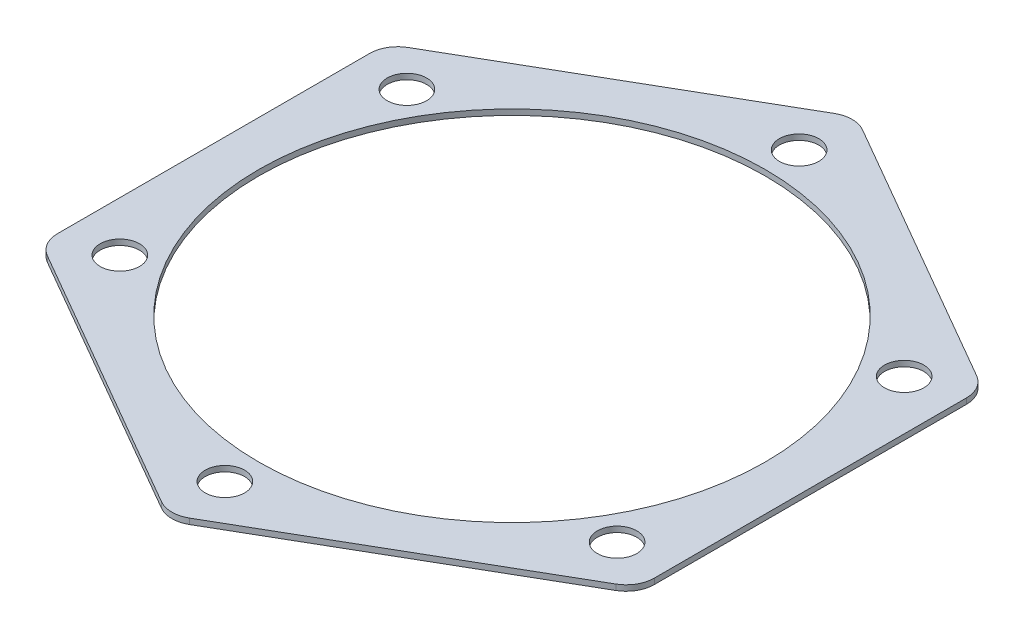
ISO-10303-21;
HEADER;
FILE_DESCRIPTION(('STEP AP214'),'2;1');
FILE_NAME('part.step','',(''),(''),'','','');
FILE_SCHEMA(('AUTOMOTIVE_DESIGN { 1 0 10303 214 1 1 1 1 }'));
ENDSEC;
DATA;
#1=APPLICATION_CONTEXT('core data for automotive mechanical design processes');
#2=APPLICATION_PROTOCOL_DEFINITION('international standard','automotive_design',2000,#1);
#3=PRODUCT_CONTEXT('',#1,'mechanical');
#4=PRODUCT('Part','Part','',(#3));
#5=PRODUCT_RELATED_PRODUCT_CATEGORY('part','',(#4));
#6=PRODUCT_DEFINITION_FORMATION('','',#4);
#7=PRODUCT_DEFINITION_CONTEXT('part definition',#1,'design');
#8=PRODUCT_DEFINITION('design','',#6,#7);
#9=PRODUCT_DEFINITION_SHAPE('','',#8);
#10=(LENGTH_UNIT() NAMED_UNIT(*) SI_UNIT(.MILLI.,.METRE.));
#11=(NAMED_UNIT(*) PLANE_ANGLE_UNIT() SI_UNIT($,.RADIAN.));
#12=(NAMED_UNIT(*) SI_UNIT($,.STERADIAN.) SOLID_ANGLE_UNIT());
#13=UNCERTAINTY_MEASURE_WITH_UNIT(LENGTH_MEASURE(1.E-05),#10,'distance_accuracy_value','');
#14=(GEOMETRIC_REPRESENTATION_CONTEXT(3) GLOBAL_UNCERTAINTY_ASSIGNED_CONTEXT((#13)) GLOBAL_UNIT_ASSIGNED_CONTEXT((#10,
#11,#12)) REPRESENTATION_CONTEXT('',''));
#15=CARTESIAN_POINT('',(0.,0.,0.));
#16=DIRECTION('',(0.,0.,1.));
#17=DIRECTION('',(1.,0.,0.));
#18=AXIS2_PLACEMENT_3D('',#15,#16,#17);
#19=CARTESIAN_POINT('',(0.,1.,-55.4256258422041));
#20=DIRECTION('',(0.,-1.,0.));
#21=DIRECTION('',(0.,0.,-1.));
#22=AXIS2_PLACEMENT_3D('',#19,#20,#21);
#23=PLANE('',#22);
#24=CARTESIAN_POINT('',(44.1672955930061,1.,-25.5000000000005));
#25=DIRECTION('',(0.,1.,0.));
#26=DIRECTION('',(-0.866025403784433,0.,0.50000000000001));
#27=AXIS2_PLACEMENT_3D('',#24,#25,#26);
#28=CIRCLE('',#27,3.5);
#29=CARTESIAN_POINT('',(41.1362066797606,1.,-23.7500000000005));
#30=VERTEX_POINT('',#29);
#31=EDGE_CURVE('E326',#30,#30,#28,.T.);
#32=ORIENTED_EDGE('',*,*,#31,.F.);
#33=EDGE_LOOP('',(#32));
#34=FACE_BOUND('',#33,.T.);
#35=CARTESIAN_POINT('',(44.1672955930066,1.,25.4999999999996));
#36=DIRECTION('',(0.,1.,0.));
#37=DIRECTION('',(-0.866025403784443,0.,-0.499999999999992));
#38=AXIS2_PLACEMENT_3D('',#35,#36,#37);
#39=CIRCLE('',#38,3.5);
#40=CARTESIAN_POINT('',(41.1362066797611,1.,23.7499999999996));
#41=VERTEX_POINT('',#40);
#42=EDGE_CURVE('E320',#41,#41,#39,.T.);
#43=ORIENTED_EDGE('',*,*,#42,.F.);
#44=EDGE_LOOP('',(#43));
#45=FACE_BOUND('',#44,.T.);
#46=CARTESIAN_POINT('',(0.,1.,51.));
#47=DIRECTION('',(0.,1.,0.));
#48=DIRECTION('',(0.,0.,-1.));
#49=AXIS2_PLACEMENT_3D('',#46,#47,#48);
#50=CIRCLE('',#49,3.5);
#51=CARTESIAN_POINT('',(0.,1.,47.5));
#52=VERTEX_POINT('',#51);
#53=EDGE_CURVE('E312',#52,#52,#50,.T.);
#54=ORIENTED_EDGE('',*,*,#53,.F.);
#55=EDGE_LOOP('',(#54));
#56=FACE_BOUND('',#55,.T.);
#57=CARTESIAN_POINT('',(-44.1672955930063,1.,25.5000000000002));
#58=DIRECTION('',(0.,1.,0.));
#59=DIRECTION('',(0.866025403784436,0.,-0.500000000000004));
#60=AXIS2_PLACEMENT_3D('',#57,#58,#59);
#61=CIRCLE('',#60,3.5);
#62=CARTESIAN_POINT('',(-41.1362066797607,1.,23.7500000000002));
#63=VERTEX_POINT('',#62);
#64=EDGE_CURVE('E305',#63,#63,#61,.T.);
#65=ORIENTED_EDGE('',*,*,#64,.F.);
#66=EDGE_LOOP('',(#65));
#67=FACE_BOUND('',#66,.T.);
#68=CARTESIAN_POINT('',(-44.1672955930064,1.,-25.4999999999999));
#69=DIRECTION('',(0.,1.,0.));
#70=DIRECTION('',(0.86602540378444,0.,0.499999999999998));
#71=AXIS2_PLACEMENT_3D('',#68,#69,#70);
#72=CIRCLE('',#71,3.5);
#73=CARTESIAN_POINT('',(-41.1362066797609,1.,-23.7499999999999));
#74=VERTEX_POINT('',#73);
#75=EDGE_CURVE('E309',#74,#74,#72,.T.);
#76=ORIENTED_EDGE('',*,*,#75,.F.);
#77=EDGE_LOOP('',(#76));
#78=FACE_BOUND('',#77,.T.);
#79=CARTESIAN_POINT('',(0.,1.,-51.));
#80=DIRECTION('',(0.,1.,0.));
#81=DIRECTION('',(0.,0.,1.));
#82=AXIS2_PLACEMENT_3D('',#79,#80,#81);
#83=CIRCLE('',#82,3.5);
#84=CARTESIAN_POINT('',(0.,1.,-47.5));
#85=VERTEX_POINT('',#84);
#86=EDGE_CURVE('E332',#85,#85,#83,.T.);
#87=ORIENTED_EDGE('',*,*,#86,.F.);
#88=EDGE_LOOP('',(#87));
#89=FACE_BOUND('',#88,.T.);
#90=CARTESIAN_POINT('',(0.,1.,-55.4256258422041));
#91=DIRECTION('',(0.,1.,0.));
#92=DIRECTION('',(0.,0.,-1.));
#93=AXIS2_PLACEMENT_3D('',#90,#91,#92);
#94=CIRCLE('',#93,5.);
#95=CARTESIAN_POINT('',(2.49999999999999,1.,-59.7557528611263));
#96=VERTEX_POINT('',#95);
#97=CARTESIAN_POINT('',(-2.50000000000005,1.,-59.7557528611263));
#98=VERTEX_POINT('',#97);
#99=EDGE_CURVE('E184',#96,#98,#94,.T.);
#100=ORIENTED_EDGE('',*,*,#99,.T.);
#101=DIRECTION('',(-0.866025403784438,0.,0.5));
#102=VECTOR('',#101,1.);
#103=CARTESIAN_POINT('',(-2.50000000000005,1.,-59.7557528611263));
#104=LINE('',#103,#102);
#105=CARTESIAN_POINT('',(-50.5,1.,-32.0429399400242));
#106=VERTEX_POINT('',#105);
#107=EDGE_CURVE('E112',#98,#106,#104,.T.);
#108=ORIENTED_EDGE('',*,*,#107,.T.);
#109=CARTESIAN_POINT('',(-48.,1.,-27.712812921102));
#110=DIRECTION('',(0.,1.,0.));
#111=DIRECTION('',(0.,0.,-1.));
#112=AXIS2_PLACEMENT_3D('',#109,#110,#111);
#113=CIRCLE('',#112,5.);
#114=CARTESIAN_POINT('',(-53.,1.,-27.712812921102));
#115=VERTEX_POINT('',#114);
#116=EDGE_CURVE('E211',#106,#115,#113,.T.);
#117=ORIENTED_EDGE('',*,*,#116,.T.);
#118=DIRECTION('',(0.,0.,1.));
#119=VECTOR('',#118,1.);
#120=CARTESIAN_POINT('',(-53.,1.,-27.712812921102));
#121=LINE('',#120,#119);
#122=CARTESIAN_POINT('',(-53.,1.,27.712812921102));
#123=VERTEX_POINT('',#122);
#124=EDGE_CURVE('E230',#115,#123,#121,.T.);
#125=ORIENTED_EDGE('',*,*,#124,.T.);
#126=CARTESIAN_POINT('',(-48.,1.,27.712812921102));
#127=DIRECTION('',(0.,1.,0.));
#128=DIRECTION('',(0.,0.,-1.));
#129=AXIS2_PLACEMENT_3D('',#126,#127,#128);
#130=CIRCLE('',#129,5.);
#131=CARTESIAN_POINT('',(-50.5,1.,32.0429399400243));
#132=VERTEX_POINT('',#131);
#133=EDGE_CURVE('E227',#123,#132,#130,.T.);
#134=ORIENTED_EDGE('',*,*,#133,.T.);
#135=DIRECTION('',(0.866025403784439,0.,0.5));
#136=VECTOR('',#135,1.);
#137=CARTESIAN_POINT('',(-50.5,1.,32.0429399400243));
#138=LINE('',#137,#136);
#139=CARTESIAN_POINT('',(-2.50000000000001,1.,59.7557528611262));
#140=VERTEX_POINT('',#139);
#141=EDGE_CURVE('E229',#132,#140,#138,.T.);
#142=ORIENTED_EDGE('',*,*,#141,.T.);
#143=CARTESIAN_POINT('',(0.,1.,55.4256258422041));
#144=DIRECTION('',(0.,1.,0.));
#145=DIRECTION('',(0.,0.,1.));
#146=AXIS2_PLACEMENT_3D('',#143,#144,#145);
#147=CIRCLE('',#146,5.);
#148=CARTESIAN_POINT('',(2.50000000000003,1.,59.7557528611262));
#149=VERTEX_POINT('',#148);
#150=EDGE_CURVE('E232',#140,#149,#147,.T.);
#151=ORIENTED_EDGE('',*,*,#150,.T.);
#152=DIRECTION('',(0.866025403784439,0.,-0.5));
#153=VECTOR('',#152,1.);
#154=CARTESIAN_POINT('',(2.50000000000003,1.,59.7557528611262));
#155=LINE('',#154,#153);
#156=CARTESIAN_POINT('',(50.5,1.,32.0429399400242));
#157=VERTEX_POINT('',#156);
#158=EDGE_CURVE('E238',#149,#157,#155,.T.);
#159=ORIENTED_EDGE('',*,*,#158,.T.);
#160=CARTESIAN_POINT('',(48.,1.,27.712812921102));
#161=DIRECTION('',(0.,1.,0.));
#162=DIRECTION('',(0.,0.,-1.));
#163=AXIS2_PLACEMENT_3D('',#160,#161,#162);
#164=CIRCLE('',#163,5.);
#165=CARTESIAN_POINT('',(53.,1.,27.712812921102));
#166=VERTEX_POINT('',#165);
#167=EDGE_CURVE('E143',#157,#166,#164,.T.);
#168=ORIENTED_EDGE('',*,*,#167,.T.);
#169=DIRECTION('',(0.,0.,-1.));
#170=VECTOR('',#169,1.);
#171=CARTESIAN_POINT('',(53.,1.,27.712812921102));
#172=LINE('',#171,#170);
#173=CARTESIAN_POINT('',(53.,1.,-27.712812921102));
#174=VERTEX_POINT('',#173);
#175=EDGE_CURVE('E137',#166,#174,#172,.T.);
#176=ORIENTED_EDGE('',*,*,#175,.T.);
#177=CARTESIAN_POINT('',(48.,1.,-27.7128129211021));
#178=DIRECTION('',(0.,1.,0.));
#179=DIRECTION('',(0.,0.,-1.));
#180=AXIS2_PLACEMENT_3D('',#177,#178,#179);
#181=CIRCLE('',#180,5.);
#182=CARTESIAN_POINT('',(50.5,1.,-32.0429399400243));
#183=VERTEX_POINT('',#182);
#184=EDGE_CURVE('E141',#174,#183,#181,.T.);
#185=ORIENTED_EDGE('',*,*,#184,.T.);
#186=DIRECTION('',(-0.866025403784439,0.,-0.5));
#187=VECTOR('',#186,1.);
#188=CARTESIAN_POINT('',(50.5,1.,-32.0429399400243));
#189=LINE('',#188,#187);
#190=EDGE_CURVE('E57',#183,#96,#189,.T.);
#191=ORIENTED_EDGE('',*,*,#190,.T.);
#192=EDGE_LOOP('',(#100,#108,#117,#125,#134,#142,#151,#159,#168,#176,#185,#191));
#193=FACE_BOUND('',#192,.T.);
#194=CARTESIAN_POINT('',(0.,1.,0.));
#195=DIRECTION('',(0.,1.,0.));
#196=DIRECTION('',(0.,0.,1.));
#197=AXIS2_PLACEMENT_3D('',#194,#195,#196);
#198=CIRCLE('',#197,45.);
#199=CARTESIAN_POINT('',(0.,1.,45.));
#200=VERTEX_POINT('',#199);
#201=EDGE_CURVE('E165',#200,#200,#198,.T.);
#202=ORIENTED_EDGE('',*,*,#201,.F.);
#203=EDGE_LOOP('',(#202));
#204=FACE_BOUND('',#203,.T.);
#205=ADVANCED_FACE('F40',(#34,#45,#56,#67,#78,#89,#193,#204),#23,.F.);
#206=CARTESIAN_POINT('',(0.,0.,-55.4256258422041));
#207=DIRECTION('',(0.,-1.,0.));
#208=DIRECTION('',(0.,0.,-1.));
#209=AXIS2_PLACEMENT_3D('',#206,#207,#208);
#210=PLANE('',#209);
#211=CARTESIAN_POINT('',(44.1672955930061,0.,-25.5000000000005));
#212=DIRECTION('',(0.,1.,0.));
#213=DIRECTION('',(-0.866025403784433,0.,0.50000000000001));
#214=AXIS2_PLACEMENT_3D('',#211,#212,#213);
#215=CIRCLE('',#214,3.5);
#216=CARTESIAN_POINT('',(41.1362066797606,0.,-23.7500000000005));
#217=VERTEX_POINT('',#216);
#218=EDGE_CURVE('E323',#217,#217,#215,.T.);
#219=ORIENTED_EDGE('',*,*,#218,.T.);
#220=EDGE_LOOP('',(#219));
#221=FACE_BOUND('',#220,.T.);
#222=CARTESIAN_POINT('',(44.1672955930066,0.,25.4999999999996));
#223=DIRECTION('',(0.,1.,0.));
#224=DIRECTION('',(-0.866025403784443,0.,-0.499999999999992));
#225=AXIS2_PLACEMENT_3D('',#222,#223,#224);
#226=CIRCLE('',#225,3.5);
#227=CARTESIAN_POINT('',(41.1362066797611,0.,23.7499999999996));
#228=VERTEX_POINT('',#227);
#229=EDGE_CURVE('E317',#228,#228,#226,.T.);
#230=ORIENTED_EDGE('',*,*,#229,.T.);
#231=EDGE_LOOP('',(#230));
#232=FACE_BOUND('',#231,.T.);
#233=CARTESIAN_POINT('',(0.,0.,51.));
#234=DIRECTION('',(0.,1.,0.));
#235=DIRECTION('',(0.,0.,-1.));
#236=AXIS2_PLACEMENT_3D('',#233,#234,#235);
#237=CIRCLE('',#236,3.5);
#238=CARTESIAN_POINT('',(0.,0.,47.5));
#239=VERTEX_POINT('',#238);
#240=EDGE_CURVE('E307',#239,#239,#237,.T.);
#241=ORIENTED_EDGE('',*,*,#240,.T.);
#242=EDGE_LOOP('',(#241));
#243=FACE_BOUND('',#242,.T.);
#244=CARTESIAN_POINT('',(-44.1672955930063,0.,25.5000000000002));
#245=DIRECTION('',(0.,1.,0.));
#246=DIRECTION('',(0.866025403784436,0.,-0.500000000000004));
#247=AXIS2_PLACEMENT_3D('',#244,#245,#246);
#248=CIRCLE('',#247,3.5);
#249=CARTESIAN_POINT('',(-41.1362066797607,0.,23.7500000000002));
#250=VERTEX_POINT('',#249);
#251=EDGE_CURVE('E302',#250,#250,#248,.T.);
#252=ORIENTED_EDGE('',*,*,#251,.T.);
#253=EDGE_LOOP('',(#252));
#254=FACE_BOUND('',#253,.T.);
#255=CARTESIAN_POINT('',(-44.1672955930064,0.,-25.4999999999999));
#256=DIRECTION('',(0.,1.,0.));
#257=DIRECTION('',(0.86602540378444,0.,0.499999999999998));
#258=AXIS2_PLACEMENT_3D('',#255,#256,#257);
#259=CIRCLE('',#258,3.5);
#260=CARTESIAN_POINT('',(-41.1362066797609,0.,-23.7499999999999));
#261=VERTEX_POINT('',#260);
#262=EDGE_CURVE('E329',#261,#261,#259,.T.);
#263=ORIENTED_EDGE('',*,*,#262,.T.);
#264=EDGE_LOOP('',(#263));
#265=FACE_BOUND('',#264,.T.);
#266=CARTESIAN_POINT('',(0.,0.,-51.));
#267=DIRECTION('',(0.,1.,0.));
#268=DIRECTION('',(0.,0.,1.));
#269=AXIS2_PLACEMENT_3D('',#266,#267,#268);
#270=CIRCLE('',#269,3.5);
#271=CARTESIAN_POINT('',(0.,0.,-47.5));
#272=VERTEX_POINT('',#271);
#273=EDGE_CURVE('E335',#272,#272,#270,.T.);
#274=ORIENTED_EDGE('',*,*,#273,.T.);
#275=EDGE_LOOP('',(#274));
#276=FACE_BOUND('',#275,.T.);
#277=CARTESIAN_POINT('',(0.,0.,-55.4256258422041));
#278=DIRECTION('',(0.,1.,0.));
#279=DIRECTION('',(0.,0.,-1.));
#280=AXIS2_PLACEMENT_3D('',#277,#278,#279);
#281=CIRCLE('',#280,5.);
#282=CARTESIAN_POINT('',(2.49999999999999,0.,-59.7557528611263));
#283=VERTEX_POINT('',#282);
#284=CARTESIAN_POINT('',(-2.50000000000005,0.,-59.7557528611263));
#285=VERTEX_POINT('',#284);
#286=EDGE_CURVE('E161',#283,#285,#281,.T.);
#287=ORIENTED_EDGE('',*,*,#286,.F.);
#288=DIRECTION('',(-0.866025403784439,0.,-0.5));
#289=VECTOR('',#288,1.);
#290=CARTESIAN_POINT('',(50.5,0.,-32.0429399400243));
#291=LINE('',#290,#289);
#292=CARTESIAN_POINT('',(50.5,0.,-32.0429399400243));
#293=VERTEX_POINT('',#292);
#294=EDGE_CURVE('E104',#293,#283,#291,.T.);
#295=ORIENTED_EDGE('',*,*,#294,.F.);
#296=CARTESIAN_POINT('',(48.,0.,-27.7128129211021));
#297=DIRECTION('',(0.,1.,0.));
#298=DIRECTION('',(0.,0.,-1.));
#299=AXIS2_PLACEMENT_3D('',#296,#297,#298);
#300=CIRCLE('',#299,5.);
#301=CARTESIAN_POINT('',(53.,0.,-27.712812921102));
#302=VERTEX_POINT('',#301);
#303=EDGE_CURVE('E98',#302,#293,#300,.T.);
#304=ORIENTED_EDGE('',*,*,#303,.F.);
#305=DIRECTION('',(0.,0.,-1.));
#306=VECTOR('',#305,1.);
#307=CARTESIAN_POINT('',(53.,0.,27.712812921102));
#308=LINE('',#307,#306);
#309=CARTESIAN_POINT('',(53.,0.,27.712812921102));
#310=VERTEX_POINT('',#309);
#311=EDGE_CURVE('E151',#310,#302,#308,.T.);
#312=ORIENTED_EDGE('',*,*,#311,.F.);
#313=CARTESIAN_POINT('',(48.,0.,27.712812921102));
#314=DIRECTION('',(0.,1.,0.));
#315=DIRECTION('',(0.,0.,-1.));
#316=AXIS2_PLACEMENT_3D('',#313,#314,#315);
#317=CIRCLE('',#316,5.);
#318=CARTESIAN_POINT('',(50.5,0.,32.0429399400242));
#319=VERTEX_POINT('',#318);
#320=EDGE_CURVE('E179',#319,#310,#317,.T.);
#321=ORIENTED_EDGE('',*,*,#320,.F.);
#322=DIRECTION('',(0.866025403784439,0.,-0.5));
#323=VECTOR('',#322,1.);
#324=CARTESIAN_POINT('',(2.50000000000003,0.,59.7557528611262));
#325=LINE('',#324,#323);
#326=CARTESIAN_POINT('',(2.50000000000003,0.,59.7557528611262));
#327=VERTEX_POINT('',#326);
#328=EDGE_CURVE('E177',#327,#319,#325,.T.);
#329=ORIENTED_EDGE('',*,*,#328,.F.);
#330=CARTESIAN_POINT('',(0.,0.,55.4256258422041));
#331=DIRECTION('',(0.,1.,0.));
#332=DIRECTION('',(0.,0.,1.));
#333=AXIS2_PLACEMENT_3D('',#330,#331,#332);
#334=CIRCLE('',#333,5.);
#335=CARTESIAN_POINT('',(-2.50000000000001,0.,59.7557528611262));
#336=VERTEX_POINT('',#335);
#337=EDGE_CURVE('E175',#336,#327,#334,.T.);
#338=ORIENTED_EDGE('',*,*,#337,.F.);
#339=DIRECTION('',(0.866025403784439,0.,0.5));
#340=VECTOR('',#339,1.);
#341=CARTESIAN_POINT('',(-50.5,0.,32.0429399400243));
#342=LINE('',#341,#340);
#343=CARTESIAN_POINT('',(-50.5,0.,32.0429399400243));
#344=VERTEX_POINT('',#343);
#345=EDGE_CURVE('E173',#344,#336,#342,.T.);
#346=ORIENTED_EDGE('',*,*,#345,.F.);
#347=CARTESIAN_POINT('',(-48.,0.,27.712812921102));
#348=DIRECTION('',(0.,1.,0.));
#349=DIRECTION('',(0.,0.,-1.));
#350=AXIS2_PLACEMENT_3D('',#347,#348,#349);
#351=CIRCLE('',#350,5.);
#352=CARTESIAN_POINT('',(-53.,0.,27.712812921102));
#353=VERTEX_POINT('',#352);
#354=EDGE_CURVE('E171',#353,#344,#351,.T.);
#355=ORIENTED_EDGE('',*,*,#354,.F.);
#356=DIRECTION('',(0.,0.,1.));
#357=VECTOR('',#356,1.);
#358=CARTESIAN_POINT('',(-53.,0.,-27.712812921102));
#359=LINE('',#358,#357);
#360=CARTESIAN_POINT('',(-53.,0.,-27.712812921102));
#361=VERTEX_POINT('',#360);
#362=EDGE_CURVE('E169',#361,#353,#359,.T.);
#363=ORIENTED_EDGE('',*,*,#362,.F.);
#364=CARTESIAN_POINT('',(-48.,0.,-27.712812921102));
#365=DIRECTION('',(0.,1.,0.));
#366=DIRECTION('',(0.,0.,-1.));
#367=AXIS2_PLACEMENT_3D('',#364,#365,#366);
#368=CIRCLE('',#367,5.);
#369=CARTESIAN_POINT('',(-50.5,0.,-32.0429399400242));
#370=VERTEX_POINT('',#369);
#371=EDGE_CURVE('E167',#370,#361,#368,.T.);
#372=ORIENTED_EDGE('',*,*,#371,.F.);
#373=DIRECTION('',(-0.866025403784438,0.,0.5));
#374=VECTOR('',#373,1.);
#375=CARTESIAN_POINT('',(-2.50000000000005,0.,-59.7557528611263));
#376=LINE('',#375,#374);
#377=EDGE_CURVE('E164',#285,#370,#376,.T.);
#378=ORIENTED_EDGE('',*,*,#377,.F.);
#379=EDGE_LOOP('',(#287,#295,#304,#312,#321,#329,#338,#346,#355,#363,#372,#378));
#380=FACE_BOUND('',#379,.T.);
#381=CARTESIAN_POINT('',(0.,0.,0.));
#382=DIRECTION('',(0.,1.,0.));
#383=DIRECTION('',(0.,0.,1.));
#384=AXIS2_PLACEMENT_3D('',#381,#382,#383);
#385=CIRCLE('',#384,45.);
#386=CARTESIAN_POINT('',(0.,0.,45.));
#387=VERTEX_POINT('',#386);
#388=EDGE_CURVE('E338',#387,#387,#385,.T.);
#389=ORIENTED_EDGE('',*,*,#388,.T.);
#390=EDGE_LOOP('',(#389));
#391=FACE_BOUND('',#390,.T.);
#392=ADVANCED_FACE('F215',(#221,#232,#243,#254,#265,#276,#380,#391),#210,.T.);
#393=CARTESIAN_POINT('',(0.,1.,-55.4256258422041));
#394=DIRECTION('',(0.,-1.,0.));
#395=DIRECTION('',(0.,0.,-1.));
#396=AXIS2_PLACEMENT_3D('',#393,#394,#395);
#397=CYLINDRICAL_SURFACE('',#396,5.);
#398=ORIENTED_EDGE('',*,*,#286,.T.);
#399=DIRECTION('',(0.,-1.,0.));
#400=VECTOR('',#399,1.);
#401=CARTESIAN_POINT('',(-2.50000000000005,1.,-59.7557528611263));
#402=LINE('',#401,#400);
#403=EDGE_CURVE('E11',#98,#285,#402,.T.);
#404=ORIENTED_EDGE('',*,*,#403,.F.);
#405=ORIENTED_EDGE('',*,*,#99,.F.);
#406=DIRECTION('',(0.,-1.,0.));
#407=VECTOR('',#406,1.);
#408=CARTESIAN_POINT('',(2.49999999999999,1.,-59.7557528611263));
#409=LINE('',#408,#407);
#410=EDGE_CURVE('E157',#96,#283,#409,.T.);
#411=ORIENTED_EDGE('',*,*,#410,.T.);
#412=EDGE_LOOP('',(#398,#404,#405,#411));
#413=FACE_BOUND('',#412,.T.);
#414=ADVANCED_FACE('F42',(#413),#397,.T.);
#415=CARTESIAN_POINT('',(-2.50000000000005,1.,-59.7557528611263));
#416=DIRECTION('',(0.5,0.,0.866025403784438));
#417=DIRECTION('',(0.866025403784439,0.,-0.5));
#418=AXIS2_PLACEMENT_3D('',#415,#416,#417);
#419=PLANE('',#418);
#420=ORIENTED_EDGE('',*,*,#377,.T.);
#421=DIRECTION('',(0.,-1.,0.));
#422=VECTOR('',#421,1.);
#423=CARTESIAN_POINT('',(-50.5,1.,-32.0429399400242));
#424=LINE('',#423,#422);
#425=EDGE_CURVE('E49',#106,#370,#424,.T.);
#426=ORIENTED_EDGE('',*,*,#425,.F.);
#427=ORIENTED_EDGE('',*,*,#107,.F.);
#428=ORIENTED_EDGE('',*,*,#403,.T.);
#429=EDGE_LOOP('',(#420,#426,#427,#428));
#430=FACE_BOUND('',#429,.T.);
#431=ADVANCED_FACE('F478',(#430),#419,.F.);
#432=CARTESIAN_POINT('',(-48.,1.,-27.712812921102));
#433=DIRECTION('',(0.,-1.,0.));
#434=DIRECTION('',(0.,0.,-1.));
#435=AXIS2_PLACEMENT_3D('',#432,#433,#434);
#436=CYLINDRICAL_SURFACE('',#435,5.);
#437=ORIENTED_EDGE('',*,*,#371,.T.);
#438=DIRECTION('',(0.,-1.,0.));
#439=VECTOR('',#438,1.);
#440=CARTESIAN_POINT('',(-53.,1.,-27.712812921102));
#441=LINE('',#440,#439);
#442=EDGE_CURVE('E203',#115,#361,#441,.T.);
#443=ORIENTED_EDGE('',*,*,#442,.F.);
#444=ORIENTED_EDGE('',*,*,#116,.F.);
#445=ORIENTED_EDGE('',*,*,#425,.T.);
#446=EDGE_LOOP('',(#437,#443,#444,#445));
#447=FACE_BOUND('',#446,.T.);
#448=ADVANCED_FACE('F209',(#447),#436,.T.);
#449=CARTESIAN_POINT('',(-53.,1.,-27.712812921102));
#450=DIRECTION('',(1.,0.,0.));
#451=DIRECTION('',(0.,0.,-1.));
#452=AXIS2_PLACEMENT_3D('',#449,#450,#451);
#453=PLANE('',#452);
#454=ORIENTED_EDGE('',*,*,#362,.T.);
#455=DIRECTION('',(0.,-1.,0.));
#456=VECTOR('',#455,1.);
#457=CARTESIAN_POINT('',(-53.,1.,27.712812921102));
#458=LINE('',#457,#456);
#459=EDGE_CURVE('E200',#123,#353,#458,.T.);
#460=ORIENTED_EDGE('',*,*,#459,.F.);
#461=ORIENTED_EDGE('',*,*,#124,.F.);
#462=ORIENTED_EDGE('',*,*,#442,.T.);
#463=EDGE_LOOP('',(#454,#460,#461,#462));
#464=FACE_BOUND('',#463,.T.);
#465=ADVANCED_FACE('F221',(#464),#453,.F.);
#466=CARTESIAN_POINT('',(-48.,1.,27.712812921102));
#467=DIRECTION('',(0.,-1.,0.));
#468=DIRECTION('',(0.,0.,-1.));
#469=AXIS2_PLACEMENT_3D('',#466,#467,#468);
#470=CYLINDRICAL_SURFACE('',#469,5.);
#471=ORIENTED_EDGE('',*,*,#354,.T.);
#472=DIRECTION('',(0.,-1.,0.));
#473=VECTOR('',#472,1.);
#474=CARTESIAN_POINT('',(-50.5,1.,32.0429399400243));
#475=LINE('',#474,#473);
#476=EDGE_CURVE('E197',#132,#344,#475,.T.);
#477=ORIENTED_EDGE('',*,*,#476,.F.);
#478=ORIENTED_EDGE('',*,*,#133,.F.);
#479=ORIENTED_EDGE('',*,*,#459,.T.);
#480=EDGE_LOOP('',(#471,#477,#478,#479));
#481=FACE_BOUND('',#480,.T.);
#482=ADVANCED_FACE('F225',(#481),#470,.T.);
#483=CARTESIAN_POINT('',(-50.5,1.,32.0429399400243));
#484=DIRECTION('',(0.5,0.,-0.866025403784439));
#485=DIRECTION('',(-0.866025403784439,0.,-0.5));
#486=AXIS2_PLACEMENT_3D('',#483,#484,#485);
#487=PLANE('',#486);
#488=ORIENTED_EDGE('',*,*,#345,.T.);
#489=DIRECTION('',(0.,-1.,0.));
#490=VECTOR('',#489,1.);
#491=CARTESIAN_POINT('',(-2.50000000000001,1.,59.7557528611262));
#492=LINE('',#491,#490);
#493=EDGE_CURVE('E194',#140,#336,#492,.T.);
#494=ORIENTED_EDGE('',*,*,#493,.F.);
#495=ORIENTED_EDGE('',*,*,#141,.F.);
#496=ORIENTED_EDGE('',*,*,#476,.T.);
#497=EDGE_LOOP('',(#488,#494,#495,#496));
#498=FACE_BOUND('',#497,.T.);
#499=ADVANCED_FACE('F447',(#498),#487,.F.);
#500=CARTESIAN_POINT('',(0.,1.,55.4256258422041));
#501=DIRECTION('',(0.,-1.,0.));
#502=DIRECTION('',(0.,0.,-1.));
#503=AXIS2_PLACEMENT_3D('',#500,#501,#502);
#504=CYLINDRICAL_SURFACE('',#503,5.);
#505=ORIENTED_EDGE('',*,*,#337,.T.);
#506=DIRECTION('',(0.,-1.,0.));
#507=VECTOR('',#506,1.);
#508=CARTESIAN_POINT('',(2.50000000000003,1.,59.7557528611262));
#509=LINE('',#508,#507);
#510=EDGE_CURVE('E191',#149,#327,#509,.T.);
#511=ORIENTED_EDGE('',*,*,#510,.F.);
#512=ORIENTED_EDGE('',*,*,#150,.F.);
#513=ORIENTED_EDGE('',*,*,#493,.T.);
#514=EDGE_LOOP('',(#505,#511,#512,#513));
#515=FACE_BOUND('',#514,.T.);
#516=ADVANCED_FACE('F439',(#515),#504,.T.);
#517=CARTESIAN_POINT('',(2.50000000000003,1.,59.7557528611262));
#518=DIRECTION('',(-0.5,0.,-0.866025403784439));
#519=DIRECTION('',(-0.866025403784439,0.,0.5));
#520=AXIS2_PLACEMENT_3D('',#517,#518,#519);
#521=PLANE('',#520);
#522=ORIENTED_EDGE('',*,*,#328,.T.);
#523=DIRECTION('',(0.,-1.,0.));
#524=VECTOR('',#523,1.);
#525=CARTESIAN_POINT('',(50.5,1.,32.0429399400242));
#526=LINE('',#525,#524);
#527=EDGE_CURVE('E188',#157,#319,#526,.T.);
#528=ORIENTED_EDGE('',*,*,#527,.F.);
#529=ORIENTED_EDGE('',*,*,#158,.F.);
#530=ORIENTED_EDGE('',*,*,#510,.T.);
#531=EDGE_LOOP('',(#522,#528,#529,#530));
#532=FACE_BOUND('',#531,.T.);
#533=ADVANCED_FACE('F244',(#532),#521,.F.);
#534=CARTESIAN_POINT('',(48.,1.,27.712812921102));
#535=DIRECTION('',(0.,-1.,0.));
#536=DIRECTION('',(0.,0.,-1.));
#537=AXIS2_PLACEMENT_3D('',#534,#535,#536);
#538=CYLINDRICAL_SURFACE('',#537,5.);
#539=ORIENTED_EDGE('',*,*,#320,.T.);
#540=DIRECTION('',(0.,-1.,0.));
#541=VECTOR('',#540,1.);
#542=CARTESIAN_POINT('',(53.,1.,27.712812921102));
#543=LINE('',#542,#541);
#544=EDGE_CURVE('E152',#166,#310,#543,.T.);
#545=ORIENTED_EDGE('',*,*,#544,.F.);
#546=ORIENTED_EDGE('',*,*,#167,.F.);
#547=ORIENTED_EDGE('',*,*,#527,.T.);
#548=EDGE_LOOP('',(#539,#545,#546,#547));
#549=FACE_BOUND('',#548,.T.);
#550=ADVANCED_FACE('F248',(#549),#538,.T.);
#551=CARTESIAN_POINT('',(53.,1.,27.712812921102));
#552=DIRECTION('',(-1.,0.,0.));
#553=DIRECTION('',(0.,0.,1.));
#554=AXIS2_PLACEMENT_3D('',#551,#552,#553);
#555=PLANE('',#554);
#556=ORIENTED_EDGE('',*,*,#311,.T.);
#557=DIRECTION('',(0.,-1.,0.));
#558=VECTOR('',#557,1.);
#559=CARTESIAN_POINT('',(53.,1.,-27.712812921102));
#560=LINE('',#559,#558);
#561=EDGE_CURVE('E148',#174,#302,#560,.T.);
#562=ORIENTED_EDGE('',*,*,#561,.F.);
#563=ORIENTED_EDGE('',*,*,#175,.F.);
#564=ORIENTED_EDGE('',*,*,#544,.T.);
#565=EDGE_LOOP('',(#556,#562,#563,#564));
#566=FACE_BOUND('',#565,.T.);
#567=ADVANCED_FACE('F149',(#566),#555,.F.);
#568=CARTESIAN_POINT('',(48.,1.,-27.7128129211021));
#569=DIRECTION('',(0.,-1.,0.));
#570=DIRECTION('',(0.,0.,-1.));
#571=AXIS2_PLACEMENT_3D('',#568,#569,#570);
#572=CYLINDRICAL_SURFACE('',#571,5.);
#573=ORIENTED_EDGE('',*,*,#303,.T.);
#574=DIRECTION('',(0.,-1.,0.));
#575=VECTOR('',#574,1.);
#576=CARTESIAN_POINT('',(50.5,1.,-32.0429399400243));
#577=LINE('',#576,#575);
#578=EDGE_CURVE('E153',#183,#293,#577,.T.);
#579=ORIENTED_EDGE('',*,*,#578,.F.);
#580=ORIENTED_EDGE('',*,*,#184,.F.);
#581=ORIENTED_EDGE('',*,*,#561,.T.);
#582=EDGE_LOOP('',(#573,#579,#580,#581));
#583=FACE_BOUND('',#582,.T.);
#584=ADVANCED_FACE('F155',(#583),#572,.T.);
#585=CARTESIAN_POINT('',(50.5,1.,-32.0429399400243));
#586=DIRECTION('',(-0.5,0.,0.866025403784439));
#587=DIRECTION('',(0.866025403784439,0.,0.5));
#588=AXIS2_PLACEMENT_3D('',#585,#586,#587);
#589=PLANE('',#588);
#590=ORIENTED_EDGE('',*,*,#294,.T.);
#591=ORIENTED_EDGE('',*,*,#410,.F.);
#592=ORIENTED_EDGE('',*,*,#190,.F.);
#593=ORIENTED_EDGE('',*,*,#578,.T.);
#594=EDGE_LOOP('',(#590,#591,#592,#593));
#595=FACE_BOUND('',#594,.T.);
#596=ADVANCED_FACE('F252',(#595),#589,.F.);
#597=CARTESIAN_POINT('',(0.,1.,0.));
#598=DIRECTION('',(0.,-1.,0.));
#599=DIRECTION('',(0.,0.,-1.));
#600=AXIS2_PLACEMENT_3D('',#597,#598,#599);
#601=CYLINDRICAL_SURFACE('',#600,45.);
#602=ORIENTED_EDGE('',*,*,#201,.T.);
#603=EDGE_LOOP('',(#602));
#604=FACE_BOUND('',#603,.T.);
#605=ORIENTED_EDGE('',*,*,#388,.F.);
#606=EDGE_LOOP('',(#605));
#607=FACE_BOUND('',#606,.T.);
#608=ADVANCED_FACE('F254',(#604,#607),#601,.F.);
#609=CARTESIAN_POINT('',(0.,0.,-51.));
#610=DIRECTION('',(0.,1.,0.));
#611=DIRECTION('',(0.,0.,1.));
#612=AXIS2_PLACEMENT_3D('',#609,#610,#611);
#613=CYLINDRICAL_SURFACE('',#612,3.5);
#614=ORIENTED_EDGE('',*,*,#273,.F.);
#615=EDGE_LOOP('',(#614));
#616=FACE_BOUND('',#615,.T.);
#617=ORIENTED_EDGE('',*,*,#86,.T.);
#618=EDGE_LOOP('',(#617));
#619=FACE_BOUND('',#618,.T.);
#620=ADVANCED_FACE('F260',(#616,#619),#613,.F.);
#621=CARTESIAN_POINT('',(-44.1672955930064,0.,-25.4999999999999));
#622=DIRECTION('',(0.,1.,0.));
#623=DIRECTION('',(0.,0.,1.));
#624=AXIS2_PLACEMENT_3D('',#621,#622,#623);
#625=CYLINDRICAL_SURFACE('',#624,3.5);
#626=ORIENTED_EDGE('',*,*,#262,.F.);
#627=EDGE_LOOP('',(#626));
#628=FACE_BOUND('',#627,.T.);
#629=ORIENTED_EDGE('',*,*,#75,.T.);
#630=EDGE_LOOP('',(#629));
#631=FACE_BOUND('',#630,.T.);
#632=ADVANCED_FACE('F277',(#628,#631),#625,.F.);
#633=CARTESIAN_POINT('',(-44.1672955930063,0.,25.5000000000002));
#634=DIRECTION('',(0.,1.,0.));
#635=DIRECTION('',(0.,0.,1.));
#636=AXIS2_PLACEMENT_3D('',#633,#634,#635);
#637=CYLINDRICAL_SURFACE('',#636,3.5);
#638=ORIENTED_EDGE('',*,*,#251,.F.);
#639=EDGE_LOOP('',(#638));
#640=FACE_BOUND('',#639,.T.);
#641=ORIENTED_EDGE('',*,*,#64,.T.);
#642=EDGE_LOOP('',(#641));
#643=FACE_BOUND('',#642,.T.);
#644=ADVANCED_FACE('F281',(#640,#643),#637,.F.);
#645=CARTESIAN_POINT('',(0.,0.,51.));
#646=DIRECTION('',(0.,1.,0.));
#647=DIRECTION('',(0.,0.,1.));
#648=AXIS2_PLACEMENT_3D('',#645,#646,#647);
#649=CYLINDRICAL_SURFACE('',#648,3.5);
#650=ORIENTED_EDGE('',*,*,#240,.F.);
#651=EDGE_LOOP('',(#650));
#652=FACE_BOUND('',#651,.T.);
#653=ORIENTED_EDGE('',*,*,#53,.T.);
#654=EDGE_LOOP('',(#653));
#655=FACE_BOUND('',#654,.T.);
#656=ADVANCED_FACE('F290',(#652,#655),#649,.F.);
#657=CARTESIAN_POINT('',(44.1672955930066,0.,25.4999999999996));
#658=DIRECTION('',(0.,1.,0.));
#659=DIRECTION('',(0.,0.,1.));
#660=AXIS2_PLACEMENT_3D('',#657,#658,#659);
#661=CYLINDRICAL_SURFACE('',#660,3.5);
#662=ORIENTED_EDGE('',*,*,#229,.F.);
#663=EDGE_LOOP('',(#662));
#664=FACE_BOUND('',#663,.T.);
#665=ORIENTED_EDGE('',*,*,#42,.T.);
#666=EDGE_LOOP('',(#665));
#667=FACE_BOUND('',#666,.T.);
#668=ADVANCED_FACE('F286',(#664,#667),#661,.F.);
#669=CARTESIAN_POINT('',(44.1672955930061,0.,-25.5000000000005));
#670=DIRECTION('',(0.,1.,0.));
#671=DIRECTION('',(0.,0.,1.));
#672=AXIS2_PLACEMENT_3D('',#669,#670,#671);
#673=CYLINDRICAL_SURFACE('',#672,3.5);
#674=ORIENTED_EDGE('',*,*,#218,.F.);
#675=EDGE_LOOP('',(#674));
#676=FACE_BOUND('',#675,.T.);
#677=ORIENTED_EDGE('',*,*,#31,.T.);
#678=EDGE_LOOP('',(#677));
#679=FACE_BOUND('',#678,.T.);
#680=ADVANCED_FACE('F283',(#676,#679),#673,.F.);
#681=CLOSED_SHELL('',(#205,#392,#414,#431,#448,#465,#482,#499,#516,#533,#550,#567,#584,#596,
#608,#620,#632,#644,#656,#668,#680));
#682=MANIFOLD_SOLID_BREP('B2',#681);
#683=ADVANCED_BREP_SHAPE_REPRESENTATION('',(#18,#682),#14);
#684=SHAPE_DEFINITION_REPRESENTATION(#9,#683);
ENDSEC;
END-ISO-10303-21;
